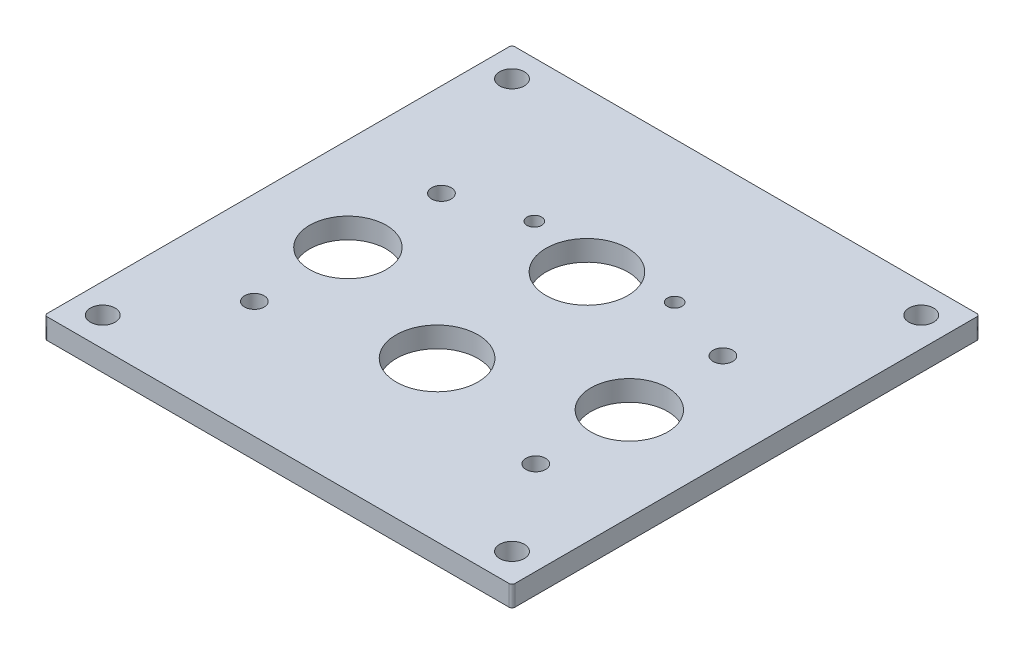
ISO-10303-21;
HEADER;
FILE_DESCRIPTION(('STEP AP214'),'2;1');
FILE_NAME('part.step','',(''),(''),'','','');
FILE_SCHEMA(('AUTOMOTIVE_DESIGN { 1 0 10303 214 1 1 1 1 }'));
ENDSEC;
DATA;
#1=APPLICATION_CONTEXT('core data for automotive mechanical design processes');
#2=APPLICATION_PROTOCOL_DEFINITION('international standard','automotive_design',2000,#1);
#3=PRODUCT_CONTEXT('',#1,'mechanical');
#4=PRODUCT('Part','Part','',(#3));
#5=PRODUCT_RELATED_PRODUCT_CATEGORY('part','',(#4));
#6=PRODUCT_DEFINITION_FORMATION('','',#4);
#7=PRODUCT_DEFINITION_CONTEXT('part definition',#1,'design');
#8=PRODUCT_DEFINITION('design','',#6,#7);
#9=PRODUCT_DEFINITION_SHAPE('','',#8);
#10=(LENGTH_UNIT() NAMED_UNIT(*) SI_UNIT(.MILLI.,.METRE.));
#11=(NAMED_UNIT(*) PLANE_ANGLE_UNIT() SI_UNIT($,.RADIAN.));
#12=(NAMED_UNIT(*) SI_UNIT($,.STERADIAN.) SOLID_ANGLE_UNIT());
#13=UNCERTAINTY_MEASURE_WITH_UNIT(LENGTH_MEASURE(1.E-05),#10,'distance_accuracy_value','');
#14=(GEOMETRIC_REPRESENTATION_CONTEXT(3) GLOBAL_UNCERTAINTY_ASSIGNED_CONTEXT((#13)) GLOBAL_UNIT_ASSIGNED_CONTEXT((#10,
#11,#12)) REPRESENTATION_CONTEXT('',''));
#15=CARTESIAN_POINT('',(0.,0.,0.));
#16=DIRECTION('',(0.,0.,1.));
#17=DIRECTION('',(1.,0.,0.));
#18=AXIS2_PLACEMENT_3D('',#15,#16,#17);
#19=CARTESIAN_POINT('',(76.3793482367759,0.,47.8960232997481));
#20=DIRECTION('',(0.,-1.,0.));
#21=DIRECTION('',(0.,0.,-1.));
#22=AXIS2_PLACEMENT_3D('',#19,#20,#21);
#23=CYLINDRICAL_SURFACE('',#22,0.793749999999989);
#24=CARTESIAN_POINT('',(76.3793482367759,0.,47.8960232997481));
#25=DIRECTION('',(0.,-1.,0.));
#26=DIRECTION('',(0.,0.,-1.));
#27=AXIS2_PLACEMENT_3D('',#24,#25,#26);
#28=CIRCLE('',#27,0.793749999999989);
#29=CARTESIAN_POINT('',(77.1730982367758,0.,47.8960232997481));
#30=VERTEX_POINT('',#29);
#31=CARTESIAN_POINT('',(76.3793482367759,0.,48.6897732997481));
#32=VERTEX_POINT('',#31);
#33=EDGE_CURVE('E92',#30,#32,#28,.T.);
#34=ORIENTED_EDGE('',*,*,#33,.T.);
#35=DIRECTION('',(0.,1.,0.));
#36=VECTOR('',#35,1.);
#37=CARTESIAN_POINT('',(76.3793482367759,0.,48.6897732997481));
#38=LINE('',#37,#36);
#39=CARTESIAN_POINT('',(76.3793482367759,-5.588,48.6897732997481));
#40=VERTEX_POINT('',#39);
#41=EDGE_CURVE('E127',#40,#32,#38,.T.);
#42=ORIENTED_EDGE('',*,*,#41,.F.);
#43=CARTESIAN_POINT('',(76.3793482367759,-5.588,47.8960232997481));
#44=DIRECTION('',(0.,-1.,0.));
#45=DIRECTION('',(0.,0.,-1.));
#46=AXIS2_PLACEMENT_3D('',#43,#44,#45);
#47=CIRCLE('',#46,0.793749999999989);
#48=CARTESIAN_POINT('',(77.1730982367758,-5.588,47.8960232997481));
#49=VERTEX_POINT('',#48);
#50=EDGE_CURVE('E27',#40,#49,#47,.F.);
#51=ORIENTED_EDGE('',*,*,#50,.T.);
#52=DIRECTION('',(0.,1.,0.));
#53=VECTOR('',#52,1.);
#54=CARTESIAN_POINT('',(77.1730982367758,0.,47.8960232997481));
#55=LINE('',#54,#53);
#56=EDGE_CURVE('E113',#30,#49,#55,.F.);
#57=ORIENTED_EDGE('',*,*,#56,.F.);
#58=EDGE_LOOP('',(#34,#42,#51,#57));
#59=FACE_BOUND('',#58,.T.);
#60=ADVANCED_FACE('F24',(#59),#23,.T.);
#61=CARTESIAN_POINT('',(-49.0331517632242,0.,47.8960232997481));
#62=DIRECTION('',(0.,-1.,0.));
#63=DIRECTION('',(0.,0.,-1.));
#64=AXIS2_PLACEMENT_3D('',#61,#62,#63);
#65=CYLINDRICAL_SURFACE('',#64,0.79375000000001);
#66=CARTESIAN_POINT('',(-49.0331517632242,0.,47.8960232997481));
#67=DIRECTION('',(0.,-1.,0.));
#68=DIRECTION('',(0.,0.,-1.));
#69=AXIS2_PLACEMENT_3D('',#66,#67,#68);
#70=CIRCLE('',#69,0.79375000000001);
#71=CARTESIAN_POINT('',(-49.0331517632242,0.,48.6897732997481));
#72=VERTEX_POINT('',#71);
#73=CARTESIAN_POINT('',(-49.8269017632242,0.,47.8960232997481));
#74=VERTEX_POINT('',#73);
#75=EDGE_CURVE('E221',#72,#74,#70,.T.);
#76=ORIENTED_EDGE('',*,*,#75,.T.);
#77=DIRECTION('',(0.,1.,0.));
#78=VECTOR('',#77,1.);
#79=CARTESIAN_POINT('',(-49.8269017632242,0.,47.8960232997481));
#80=LINE('',#79,#78);
#81=CARTESIAN_POINT('',(-49.8269017632242,-5.588,47.8960232997481));
#82=VERTEX_POINT('',#81);
#83=EDGE_CURVE('E135',#82,#74,#80,.T.);
#84=ORIENTED_EDGE('',*,*,#83,.F.);
#85=CARTESIAN_POINT('',(-49.0331517632242,-5.588,47.8960232997481));
#86=DIRECTION('',(0.,-1.,0.));
#87=DIRECTION('',(0.,0.,-1.));
#88=AXIS2_PLACEMENT_3D('',#85,#86,#87);
#89=CIRCLE('',#88,0.79375000000001);
#90=CARTESIAN_POINT('',(-49.0331517632242,-5.588,48.6897732997481));
#91=VERTEX_POINT('',#90);
#92=EDGE_CURVE('E224',#82,#91,#89,.F.);
#93=ORIENTED_EDGE('',*,*,#92,.T.);
#94=DIRECTION('',(0.,1.,0.));
#95=VECTOR('',#94,1.);
#96=CARTESIAN_POINT('',(-49.0331517632242,0.,48.6897732997481));
#97=LINE('',#96,#95);
#98=EDGE_CURVE('E124',#72,#91,#97,.F.);
#99=ORIENTED_EDGE('',*,*,#98,.F.);
#100=EDGE_LOOP('',(#76,#84,#93,#99));
#101=FACE_BOUND('',#100,.T.);
#102=ADVANCED_FACE('F229',(#101),#65,.T.);
#103=CARTESIAN_POINT('',(-49.0331517632242,0.,-77.5164767002519));
#104=DIRECTION('',(0.,-1.,0.));
#105=DIRECTION('',(0.,0.,-1.));
#106=AXIS2_PLACEMENT_3D('',#103,#104,#105);
#107=CYLINDRICAL_SURFACE('',#106,0.793749999999996);
#108=CARTESIAN_POINT('',(-49.0331517632242,0.,-77.5164767002519));
#109=DIRECTION('',(0.,-1.,0.));
#110=DIRECTION('',(0.,0.,-1.));
#111=AXIS2_PLACEMENT_3D('',#108,#109,#110);
#112=CIRCLE('',#111,0.793749999999996);
#113=CARTESIAN_POINT('',(-49.8269017632242,0.,-77.5164767002519));
#114=VERTEX_POINT('',#113);
#115=CARTESIAN_POINT('',(-49.0331517632242,0.,-78.3102267002519));
#116=VERTEX_POINT('',#115);
#117=EDGE_CURVE('E219',#114,#116,#112,.T.);
#118=ORIENTED_EDGE('',*,*,#117,.T.);
#119=DIRECTION('',(0.,1.,0.));
#120=VECTOR('',#119,1.);
#121=CARTESIAN_POINT('',(-49.0331517632242,0.,-78.3102267002519));
#122=LINE('',#121,#120);
#123=CARTESIAN_POINT('',(-49.0331517632242,-5.588,-78.3102267002519));
#124=VERTEX_POINT('',#123);
#125=EDGE_CURVE('E130',#124,#116,#122,.T.);
#126=ORIENTED_EDGE('',*,*,#125,.F.);
#127=CARTESIAN_POINT('',(-49.0331517632242,-5.588,-77.5164767002519));
#128=DIRECTION('',(0.,-1.,0.));
#129=DIRECTION('',(0.,0.,-1.));
#130=AXIS2_PLACEMENT_3D('',#127,#128,#129);
#131=CIRCLE('',#130,0.793749999999996);
#132=CARTESIAN_POINT('',(-49.8269017632242,-5.588,-77.5164767002519));
#133=VERTEX_POINT('',#132);
#134=EDGE_CURVE('E41',#124,#133,#131,.F.);
#135=ORIENTED_EDGE('',*,*,#134,.T.);
#136=DIRECTION('',(0.,1.,0.));
#137=VECTOR('',#136,1.);
#138=CARTESIAN_POINT('',(-49.8269017632242,0.,-77.5164767002519));
#139=LINE('',#138,#137);
#140=EDGE_CURVE('E134',#114,#133,#139,.F.);
#141=ORIENTED_EDGE('',*,*,#140,.F.);
#142=EDGE_LOOP('',(#118,#126,#135,#141));
#143=FACE_BOUND('',#142,.T.);
#144=ADVANCED_FACE('F253',(#143),#107,.T.);
#145=CARTESIAN_POINT('',(76.3793482367759,0.,-77.5164767002519));
#146=DIRECTION('',(0.,-1.,0.));
#147=DIRECTION('',(0.,0.,-1.));
#148=AXIS2_PLACEMENT_3D('',#145,#146,#147);
#149=PLANE('',#148);
#150=DIRECTION('',(-1.,0.,0.));
#151=VECTOR('',#150,1.);
#152=CARTESIAN_POINT('',(-49.0331517632242,0.,-78.3102267002519));
#153=LINE('',#152,#151);
#154=CARTESIAN_POINT('',(76.3793482367759,0.,-78.3102267002519));
#155=VERTEX_POINT('',#154);
#156=EDGE_CURVE('E128',#116,#155,#153,.F.);
#157=ORIENTED_EDGE('',*,*,#156,.F.);
#158=ORIENTED_EDGE('',*,*,#117,.F.);
#159=DIRECTION('',(0.,0.,1.));
#160=VECTOR('',#159,1.);
#161=CARTESIAN_POINT('',(-49.8269017632242,0.,47.8960232997481));
#162=LINE('',#161,#160);
#163=EDGE_CURVE('E131',#74,#114,#162,.F.);
#164=ORIENTED_EDGE('',*,*,#163,.F.);
#165=ORIENTED_EDGE('',*,*,#75,.F.);
#166=DIRECTION('',(1.,0.,0.));
#167=VECTOR('',#166,1.);
#168=CARTESIAN_POINT('',(76.3793482367759,0.,48.6897732997481));
#169=LINE('',#168,#167);
#170=EDGE_CURVE('E136',#32,#72,#169,.F.);
#171=ORIENTED_EDGE('',*,*,#170,.F.);
#172=ORIENTED_EDGE('',*,*,#33,.F.);
#173=DIRECTION('',(0.,0.,-1.));
#174=VECTOR('',#173,1.);
#175=CARTESIAN_POINT('',(77.1730982367758,0.,-77.5164767002519));
#176=LINE('',#175,#174);
#177=CARTESIAN_POINT('',(77.1730982367758,0.,-77.5164767002519));
#178=VERTEX_POINT('',#177);
#179=EDGE_CURVE('E109',#178,#30,#176,.F.);
#180=ORIENTED_EDGE('',*,*,#179,.F.);
#181=CARTESIAN_POINT('',(76.3793482367759,0.,-77.5164767002519));
#182=DIRECTION('',(0.,-1.,0.));
#183=DIRECTION('',(0.,0.,-1.));
#184=AXIS2_PLACEMENT_3D('',#181,#182,#183);
#185=CIRCLE('',#184,0.793749999999996);
#186=EDGE_CURVE('E97',#155,#178,#185,.T.);
#187=ORIENTED_EDGE('',*,*,#186,.F.);
#188=EDGE_LOOP('',(#157,#158,#164,#165,#171,#172,#180,#187));
#189=FACE_BOUND('',#188,.T.);
#190=CARTESIAN_POINT('',(-5.37690176322416,0.,-39.9181267002519));
#191=DIRECTION('',(0.,-1.,0.));
#192=DIRECTION('',(0.,0.,-1.));
#193=AXIS2_PLACEMENT_3D('',#190,#191,#192);
#194=CIRCLE('',#193,1.98374);
#195=CARTESIAN_POINT('',(-5.37690176322416,0.,-41.9018667002519));
#196=VERTEX_POINT('',#195);
#197=EDGE_CURVE('E117',#196,#196,#194,.T.);
#198=ORIENTED_EDGE('',*,*,#197,.T.);
#199=EDGE_LOOP('',(#198));
#200=FACE_BOUND('',#199,.T.);
#201=CARTESIAN_POINT('',(32.7230982367758,0.,-39.9181267002519));
#202=DIRECTION('',(0.,-1.,0.));
#203=DIRECTION('',(0.,0.,-1.));
#204=AXIS2_PLACEMENT_3D('',#201,#202,#203);
#205=CIRCLE('',#204,1.98374);
#206=CARTESIAN_POINT('',(32.7230982367758,0.,-41.9018667002519));
#207=VERTEX_POINT('',#206);
#208=EDGE_CURVE('E120',#207,#207,#205,.T.);
#209=ORIENTED_EDGE('',*,*,#208,.T.);
#210=EDGE_LOOP('',(#209));
#211=FACE_BOUND('',#210,.T.);
#212=CARTESIAN_POINT('',(51.8813432040601,0.,-33.8602267002519));
#213=DIRECTION('',(0.,-1.,0.));
#214=DIRECTION('',(0.,0.,-1.));
#215=AXIS2_PLACEMENT_3D('',#212,#213,#214);
#216=CIRCLE('',#215,2.667);
#217=CARTESIAN_POINT('',(51.8813432040601,0.,-36.5272267002519));
#218=VERTEX_POINT('',#217);
#219=EDGE_CURVE('E183',#218,#218,#216,.T.);
#220=ORIENTED_EDGE('',*,*,#219,.T.);
#221=EDGE_LOOP('',(#220));
#222=FACE_BOUND('',#221,.T.);
#223=CARTESIAN_POINT('',(-41.8894017632242,0.,40.7522732997481));
#224=DIRECTION('',(0.,-1.,0.));
#225=DIRECTION('',(0.,0.,-1.));
#226=AXIS2_PLACEMENT_3D('',#223,#224,#225);
#227=CIRCLE('',#226,3.3528);
#228=CARTESIAN_POINT('',(-41.8894017632242,0.,37.3994732997481));
#229=VERTEX_POINT('',#228);
#230=EDGE_CURVE('E186',#229,#229,#227,.T.);
#231=ORIENTED_EDGE('',*,*,#230,.T.);
#232=EDGE_LOOP('',(#231));
#233=FACE_BOUND('',#232,.T.);
#234=CARTESIAN_POINT('',(13.6730982367758,0.,5.53517329974811));
#235=DIRECTION('',(0.,-1.,0.));
#236=DIRECTION('',(0.,0.,-1.));
#237=AXIS2_PLACEMENT_3D('',#234,#235,#236);
#238=CIRCLE('',#237,11.1125);
#239=CARTESIAN_POINT('',(13.6730982367758,0.,-5.57732670025189));
#240=VERTEX_POINT('',#239);
#241=EDGE_CURVE('E189',#240,#240,#238,.T.);
#242=ORIENTED_EDGE('',*,*,#241,.T.);
#243=EDGE_LOOP('',(#242));
#244=FACE_BOUND('',#243,.T.);
#245=CARTESIAN_POINT('',(69.2355982367759,0.,-70.3727267002519));
#246=DIRECTION('',(0.,-1.,0.));
#247=DIRECTION('',(0.,0.,-1.));
#248=AXIS2_PLACEMENT_3D('',#245,#246,#247);
#249=CIRCLE('',#248,3.3528);
#250=CARTESIAN_POINT('',(69.2355982367759,0.,-73.7255267002519));
#251=VERTEX_POINT('',#250);
#252=EDGE_CURVE('E192',#251,#251,#249,.T.);
#253=ORIENTED_EDGE('',*,*,#252,.T.);
#254=EDGE_LOOP('',(#253));
#255=FACE_BOUND('',#254,.T.);
#256=CARTESIAN_POINT('',(69.2355982367758,0.,40.7522732997481));
#257=DIRECTION('',(0.,-1.,0.));
#258=DIRECTION('',(0.,0.,-1.));
#259=AXIS2_PLACEMENT_3D('',#256,#257,#258);
#260=CIRCLE('',#259,3.3528);
#261=CARTESIAN_POINT('',(69.2355982367758,0.,37.3994732997481));
#262=VERTEX_POINT('',#261);
#263=EDGE_CURVE('E195',#262,#262,#260,.T.);
#264=ORIENTED_EDGE('',*,*,#263,.T.);
#265=EDGE_LOOP('',(#264));
#266=FACE_BOUND('',#265,.T.);
#267=CARTESIAN_POINT('',(-41.8894017632242,0.,-70.3727267002519));
#268=DIRECTION('',(0.,-1.,0.));
#269=DIRECTION('',(0.,0.,-1.));
#270=AXIS2_PLACEMENT_3D('',#267,#268,#269);
#271=CIRCLE('',#270,3.3528);
#272=CARTESIAN_POINT('',(-41.8894017632242,0.,-73.7255267002519));
#273=VERTEX_POINT('',#272);
#274=EDGE_CURVE('E198',#273,#273,#271,.T.);
#275=ORIENTED_EDGE('',*,*,#274,.T.);
#276=EDGE_LOOP('',(#275));
#277=FACE_BOUND('',#276,.T.);
#278=CARTESIAN_POINT('',(13.6730982367758,0.,-35.1556267002519));
#279=DIRECTION('',(0.,-1.,0.));
#280=DIRECTION('',(0.,0.,-1.));
#281=AXIS2_PLACEMENT_3D('',#278,#279,#280);
#282=CIRCLE('',#281,11.1125);
#283=CARTESIAN_POINT('',(13.6730982367758,0.,-46.2681267002519));
#284=VERTEX_POINT('',#283);
#285=EDGE_CURVE('E201',#284,#284,#282,.T.);
#286=ORIENTED_EDGE('',*,*,#285,.T.);
#287=EDGE_LOOP('',(#286));
#288=FACE_BOUND('',#287,.T.);
#289=CARTESIAN_POINT('',(51.8813432040601,0.,16.9397732997481));
#290=DIRECTION('',(0.,-1.,0.));
#291=DIRECTION('',(0.,0.,-1.));
#292=AXIS2_PLACEMENT_3D('',#289,#290,#291);
#293=CIRCLE('',#292,2.667);
#294=CARTESIAN_POINT('',(51.8813432040601,0.,14.2727732997481));
#295=VERTEX_POINT('',#294);
#296=EDGE_CURVE('E204',#295,#295,#293,.T.);
#297=ORIENTED_EDGE('',*,*,#296,.T.);
#298=EDGE_LOOP('',(#297));
#299=FACE_BOUND('',#298,.T.);
#300=CARTESIAN_POINT('',(-24.5351467305084,0.,-8.4602267002519));
#301=DIRECTION('',(0.,-1.,0.));
#302=DIRECTION('',(0.,0.,-1.));
#303=AXIS2_PLACEMENT_3D('',#300,#301,#302);
#304=CIRCLE('',#303,10.414);
#305=CARTESIAN_POINT('',(-24.5351467305084,0.,-18.8742267002519));
#306=VERTEX_POINT('',#305);
#307=EDGE_CURVE('E207',#306,#306,#304,.T.);
#308=ORIENTED_EDGE('',*,*,#307,.T.);
#309=EDGE_LOOP('',(#308));
#310=FACE_BOUND('',#309,.T.);
#311=CARTESIAN_POINT('',(-24.5351467305084,0.,16.9397732997481));
#312=DIRECTION('',(0.,-1.,0.));
#313=DIRECTION('',(0.,0.,-1.));
#314=AXIS2_PLACEMENT_3D('',#311,#312,#313);
#315=CIRCLE('',#314,2.667);
#316=CARTESIAN_POINT('',(-24.5351467305084,0.,14.2727732997481));
#317=VERTEX_POINT('',#316);
#318=EDGE_CURVE('E210',#317,#317,#315,.T.);
#319=ORIENTED_EDGE('',*,*,#318,.T.);
#320=EDGE_LOOP('',(#319));
#321=FACE_BOUND('',#320,.T.);
#322=CARTESIAN_POINT('',(-24.5351467305084,0.,-33.8602267002519));
#323=DIRECTION('',(0.,-1.,0.));
#324=DIRECTION('',(0.,0.,-1.));
#325=AXIS2_PLACEMENT_3D('',#322,#323,#324);
#326=CIRCLE('',#325,2.667);
#327=CARTESIAN_POINT('',(-24.5351467305084,0.,-36.5272267002519));
#328=VERTEX_POINT('',#327);
#329=EDGE_CURVE('E213',#328,#328,#326,.T.);
#330=ORIENTED_EDGE('',*,*,#329,.T.);
#331=EDGE_LOOP('',(#330));
#332=FACE_BOUND('',#331,.T.);
#333=CARTESIAN_POINT('',(51.8813432040601,0.,-8.4602267002519));
#334=DIRECTION('',(0.,-1.,0.));
#335=DIRECTION('',(0.,0.,-1.));
#336=AXIS2_PLACEMENT_3D('',#333,#334,#335);
#337=CIRCLE('',#336,10.414);
#338=CARTESIAN_POINT('',(51.8813432040601,0.,-18.8742267002519));
#339=VERTEX_POINT('',#338);
#340=EDGE_CURVE('E106',#339,#339,#337,.T.);
#341=ORIENTED_EDGE('',*,*,#340,.T.);
#342=EDGE_LOOP('',(#341));
#343=FACE_BOUND('',#342,.T.);
#344=ADVANCED_FACE('F110',(#189,#200,#211,#222,#233,#244,#255,#266,#277,#288,#299,#310,#321,
#332,#343),#149,.F.);
#345=CARTESIAN_POINT('',(76.3793482367759,0.,-77.5164767002519));
#346=DIRECTION('',(0.,-1.,0.));
#347=DIRECTION('',(0.,0.,-1.));
#348=AXIS2_PLACEMENT_3D('',#345,#346,#347);
#349=CYLINDRICAL_SURFACE('',#348,0.793749999999996);
#350=ORIENTED_EDGE('',*,*,#186,.T.);
#351=DIRECTION('',(0.,1.,0.));
#352=VECTOR('',#351,1.);
#353=CARTESIAN_POINT('',(77.1730982367758,0.,-77.5164767002519));
#354=LINE('',#353,#352);
#355=CARTESIAN_POINT('',(77.1730982367758,-5.588,-77.5164767002519));
#356=VERTEX_POINT('',#355);
#357=EDGE_CURVE('E100',#356,#178,#354,.T.);
#358=ORIENTED_EDGE('',*,*,#357,.F.);
#359=CARTESIAN_POINT('',(76.3793482367759,-5.588,-77.5164767002519));
#360=DIRECTION('',(0.,-1.,0.));
#361=DIRECTION('',(0.,0.,-1.));
#362=AXIS2_PLACEMENT_3D('',#359,#360,#361);
#363=CIRCLE('',#362,0.793749999999996);
#364=CARTESIAN_POINT('',(76.3793482367759,-5.588,-78.3102267002519));
#365=VERTEX_POINT('',#364);
#366=EDGE_CURVE('E67',#356,#365,#363,.F.);
#367=ORIENTED_EDGE('',*,*,#366,.T.);
#368=DIRECTION('',(0.,1.,0.));
#369=VECTOR('',#368,1.);
#370=CARTESIAN_POINT('',(76.3793482367759,0.,-78.3102267002519));
#371=LINE('',#370,#369);
#372=EDGE_CURVE('E103',#155,#365,#371,.F.);
#373=ORIENTED_EDGE('',*,*,#372,.F.);
#374=EDGE_LOOP('',(#350,#358,#367,#373));
#375=FACE_BOUND('',#374,.T.);
#376=ADVANCED_FACE('F98',(#375),#349,.T.);
#377=CARTESIAN_POINT('',(51.8813432040601,0.,-8.4602267002519));
#378=DIRECTION('',(0.,-1.,0.));
#379=DIRECTION('',(0.,0.,-1.));
#380=AXIS2_PLACEMENT_3D('',#377,#378,#379);
#381=CYLINDRICAL_SURFACE('',#380,10.414);
#382=CARTESIAN_POINT('',(51.8813432040601,-5.588,-8.4602267002519));
#383=DIRECTION('',(0.,-1.,0.));
#384=DIRECTION('',(0.,0.,-1.));
#385=AXIS2_PLACEMENT_3D('',#382,#383,#384);
#386=CIRCLE('',#385,10.414);
#387=CARTESIAN_POINT('',(51.8813432040601,-5.588,-18.8742267002519));
#388=VERTEX_POINT('',#387);
#389=EDGE_CURVE('E178',#388,#388,#386,.F.);
#390=ORIENTED_EDGE('',*,*,#389,.F.);
#391=EDGE_LOOP('',(#390));
#392=FACE_BOUND('',#391,.T.);
#393=ORIENTED_EDGE('',*,*,#340,.F.);
#394=EDGE_LOOP('',(#393));
#395=FACE_BOUND('',#394,.T.);
#396=ADVANCED_FACE('F322',(#392,#395),#381,.F.);
#397=CARTESIAN_POINT('',(-24.5351467305084,0.,-33.8602267002519));
#398=DIRECTION('',(0.,-1.,0.));
#399=DIRECTION('',(0.,0.,-1.));
#400=AXIS2_PLACEMENT_3D('',#397,#398,#399);
#401=CYLINDRICAL_SURFACE('',#400,2.667);
#402=CARTESIAN_POINT('',(-24.5351467305084,-5.588,-33.8602267002519));
#403=DIRECTION('',(0.,-1.,0.));
#404=DIRECTION('',(0.,0.,-1.));
#405=AXIS2_PLACEMENT_3D('',#402,#403,#404);
#406=CIRCLE('',#405,2.667);
#407=CARTESIAN_POINT('',(-24.5351467305084,-5.588,-36.5272267002519));
#408=VERTEX_POINT('',#407);
#409=EDGE_CURVE('E175',#408,#408,#406,.F.);
#410=ORIENTED_EDGE('',*,*,#409,.F.);
#411=EDGE_LOOP('',(#410));
#412=FACE_BOUND('',#411,.T.);
#413=ORIENTED_EDGE('',*,*,#329,.F.);
#414=EDGE_LOOP('',(#413));
#415=FACE_BOUND('',#414,.T.);
#416=ADVANCED_FACE('F318',(#412,#415),#401,.F.);
#417=CARTESIAN_POINT('',(-24.5351467305084,0.,16.9397732997481));
#418=DIRECTION('',(0.,-1.,0.));
#419=DIRECTION('',(0.,0.,-1.));
#420=AXIS2_PLACEMENT_3D('',#417,#418,#419);
#421=CYLINDRICAL_SURFACE('',#420,2.667);
#422=CARTESIAN_POINT('',(-24.5351467305084,-5.588,16.9397732997481));
#423=DIRECTION('',(0.,-1.,0.));
#424=DIRECTION('',(0.,0.,-1.));
#425=AXIS2_PLACEMENT_3D('',#422,#423,#424);
#426=CIRCLE('',#425,2.667);
#427=CARTESIAN_POINT('',(-24.5351467305084,-5.588,14.2727732997481));
#428=VERTEX_POINT('',#427);
#429=EDGE_CURVE('E172',#428,#428,#426,.F.);
#430=ORIENTED_EDGE('',*,*,#429,.F.);
#431=EDGE_LOOP('',(#430));
#432=FACE_BOUND('',#431,.T.);
#433=ORIENTED_EDGE('',*,*,#318,.F.);
#434=EDGE_LOOP('',(#433));
#435=FACE_BOUND('',#434,.T.);
#436=ADVANCED_FACE('F314',(#432,#435),#421,.F.);
#437=CARTESIAN_POINT('',(-24.5351467305084,0.,-8.4602267002519));
#438=DIRECTION('',(0.,-1.,0.));
#439=DIRECTION('',(0.,0.,-1.));
#440=AXIS2_PLACEMENT_3D('',#437,#438,#439);
#441=CYLINDRICAL_SURFACE('',#440,10.414);
#442=CARTESIAN_POINT('',(-24.5351467305084,-5.588,-8.4602267002519));
#443=DIRECTION('',(0.,-1.,0.));
#444=DIRECTION('',(0.,0.,-1.));
#445=AXIS2_PLACEMENT_3D('',#442,#443,#444);
#446=CIRCLE('',#445,10.414);
#447=CARTESIAN_POINT('',(-24.5351467305084,-5.588,-18.8742267002519));
#448=VERTEX_POINT('',#447);
#449=EDGE_CURVE('E169',#448,#448,#446,.F.);
#450=ORIENTED_EDGE('',*,*,#449,.F.);
#451=EDGE_LOOP('',(#450));
#452=FACE_BOUND('',#451,.T.);
#453=ORIENTED_EDGE('',*,*,#307,.F.);
#454=EDGE_LOOP('',(#453));
#455=FACE_BOUND('',#454,.T.);
#456=ADVANCED_FACE('F310',(#452,#455),#441,.F.);
#457=CARTESIAN_POINT('',(51.8813432040601,0.,16.9397732997481));
#458=DIRECTION('',(0.,-1.,0.));
#459=DIRECTION('',(0.,0.,-1.));
#460=AXIS2_PLACEMENT_3D('',#457,#458,#459);
#461=CYLINDRICAL_SURFACE('',#460,2.667);
#462=CARTESIAN_POINT('',(51.8813432040601,-5.588,16.9397732997481));
#463=DIRECTION('',(0.,-1.,0.));
#464=DIRECTION('',(0.,0.,-1.));
#465=AXIS2_PLACEMENT_3D('',#462,#463,#464);
#466=CIRCLE('',#465,2.667);
#467=CARTESIAN_POINT('',(51.8813432040601,-5.588,14.2727732997481));
#468=VERTEX_POINT('',#467);
#469=EDGE_CURVE('E166',#468,#468,#466,.F.);
#470=ORIENTED_EDGE('',*,*,#469,.F.);
#471=EDGE_LOOP('',(#470));
#472=FACE_BOUND('',#471,.T.);
#473=ORIENTED_EDGE('',*,*,#296,.F.);
#474=EDGE_LOOP('',(#473));
#475=FACE_BOUND('',#474,.T.);
#476=ADVANCED_FACE('F306',(#472,#475),#461,.F.);
#477=CARTESIAN_POINT('',(13.6730982367758,0.,-35.1556267002519));
#478=DIRECTION('',(0.,-1.,0.));
#479=DIRECTION('',(0.,0.,-1.));
#480=AXIS2_PLACEMENT_3D('',#477,#478,#479);
#481=CYLINDRICAL_SURFACE('',#480,11.1125);
#482=CARTESIAN_POINT('',(13.6730982367758,-5.588,-35.1556267002519));
#483=DIRECTION('',(0.,-1.,0.));
#484=DIRECTION('',(0.,0.,-1.));
#485=AXIS2_PLACEMENT_3D('',#482,#483,#484);
#486=CIRCLE('',#485,11.1125);
#487=CARTESIAN_POINT('',(13.6730982367758,-5.588,-46.2681267002519));
#488=VERTEX_POINT('',#487);
#489=EDGE_CURVE('E163',#488,#488,#486,.F.);
#490=ORIENTED_EDGE('',*,*,#489,.F.);
#491=EDGE_LOOP('',(#490));
#492=FACE_BOUND('',#491,.T.);
#493=ORIENTED_EDGE('',*,*,#285,.F.);
#494=EDGE_LOOP('',(#493));
#495=FACE_BOUND('',#494,.T.);
#496=ADVANCED_FACE('F302',(#492,#495),#481,.F.);
#497=CARTESIAN_POINT('',(-41.8894017632242,0.,-70.3727267002519));
#498=DIRECTION('',(0.,-1.,0.));
#499=DIRECTION('',(0.,0.,-1.));
#500=AXIS2_PLACEMENT_3D('',#497,#498,#499);
#501=CYLINDRICAL_SURFACE('',#500,3.3528);
#502=CARTESIAN_POINT('',(-41.8894017632242,-5.588,-70.3727267002519));
#503=DIRECTION('',(0.,-1.,0.));
#504=DIRECTION('',(0.,0.,-1.));
#505=AXIS2_PLACEMENT_3D('',#502,#503,#504);
#506=CIRCLE('',#505,3.3528);
#507=CARTESIAN_POINT('',(-41.8894017632242,-5.588,-73.7255267002519));
#508=VERTEX_POINT('',#507);
#509=EDGE_CURVE('E160',#508,#508,#506,.F.);
#510=ORIENTED_EDGE('',*,*,#509,.F.);
#511=EDGE_LOOP('',(#510));
#512=FACE_BOUND('',#511,.T.);
#513=ORIENTED_EDGE('',*,*,#274,.F.);
#514=EDGE_LOOP('',(#513));
#515=FACE_BOUND('',#514,.T.);
#516=ADVANCED_FACE('F298',(#512,#515),#501,.F.);
#517=CARTESIAN_POINT('',(69.2355982367758,0.,40.7522732997481));
#518=DIRECTION('',(0.,-1.,0.));
#519=DIRECTION('',(0.,0.,-1.));
#520=AXIS2_PLACEMENT_3D('',#517,#518,#519);
#521=CYLINDRICAL_SURFACE('',#520,3.3528);
#522=CARTESIAN_POINT('',(69.2355982367758,-5.588,40.7522732997481));
#523=DIRECTION('',(0.,-1.,0.));
#524=DIRECTION('',(0.,0.,-1.));
#525=AXIS2_PLACEMENT_3D('',#522,#523,#524);
#526=CIRCLE('',#525,3.3528);
#527=CARTESIAN_POINT('',(69.2355982367758,-5.588,37.3994732997481));
#528=VERTEX_POINT('',#527);
#529=EDGE_CURVE('E157',#528,#528,#526,.F.);
#530=ORIENTED_EDGE('',*,*,#529,.F.);
#531=EDGE_LOOP('',(#530));
#532=FACE_BOUND('',#531,.T.);
#533=ORIENTED_EDGE('',*,*,#263,.F.);
#534=EDGE_LOOP('',(#533));
#535=FACE_BOUND('',#534,.T.);
#536=ADVANCED_FACE('F294',(#532,#535),#521,.F.);
#537=CARTESIAN_POINT('',(69.2355982367759,0.,-70.3727267002519));
#538=DIRECTION('',(0.,-1.,0.));
#539=DIRECTION('',(0.,0.,-1.));
#540=AXIS2_PLACEMENT_3D('',#537,#538,#539);
#541=CYLINDRICAL_SURFACE('',#540,3.3528);
#542=CARTESIAN_POINT('',(69.2355982367759,-5.588,-70.3727267002519));
#543=DIRECTION('',(0.,-1.,0.));
#544=DIRECTION('',(0.,0.,-1.));
#545=AXIS2_PLACEMENT_3D('',#542,#543,#544);
#546=CIRCLE('',#545,3.3528);
#547=CARTESIAN_POINT('',(69.2355982367759,-5.588,-73.7255267002519));
#548=VERTEX_POINT('',#547);
#549=EDGE_CURVE('E154',#548,#548,#546,.F.);
#550=ORIENTED_EDGE('',*,*,#549,.F.);
#551=EDGE_LOOP('',(#550));
#552=FACE_BOUND('',#551,.T.);
#553=ORIENTED_EDGE('',*,*,#252,.F.);
#554=EDGE_LOOP('',(#553));
#555=FACE_BOUND('',#554,.T.);
#556=ADVANCED_FACE('F290',(#552,#555),#541,.F.);
#557=CARTESIAN_POINT('',(13.6730982367758,0.,5.53517329974811));
#558=DIRECTION('',(0.,-1.,0.));
#559=DIRECTION('',(0.,0.,-1.));
#560=AXIS2_PLACEMENT_3D('',#557,#558,#559);
#561=CYLINDRICAL_SURFACE('',#560,11.1125);
#562=CARTESIAN_POINT('',(13.6730982367758,-5.588,5.53517329974811));
#563=DIRECTION('',(0.,-1.,0.));
#564=DIRECTION('',(0.,0.,-1.));
#565=AXIS2_PLACEMENT_3D('',#562,#563,#564);
#566=CIRCLE('',#565,11.1125);
#567=CARTESIAN_POINT('',(13.6730982367758,-5.588,-5.57732670025189));
#568=VERTEX_POINT('',#567);
#569=EDGE_CURVE('E151',#568,#568,#566,.F.);
#570=ORIENTED_EDGE('',*,*,#569,.F.);
#571=EDGE_LOOP('',(#570));
#572=FACE_BOUND('',#571,.T.);
#573=ORIENTED_EDGE('',*,*,#241,.F.);
#574=EDGE_LOOP('',(#573));
#575=FACE_BOUND('',#574,.T.);
#576=ADVANCED_FACE('F286',(#572,#575),#561,.F.);
#577=CARTESIAN_POINT('',(-41.8894017632242,0.,40.7522732997481));
#578=DIRECTION('',(0.,-1.,0.));
#579=DIRECTION('',(0.,0.,-1.));
#580=AXIS2_PLACEMENT_3D('',#577,#578,#579);
#581=CYLINDRICAL_SURFACE('',#580,3.3528);
#582=CARTESIAN_POINT('',(-41.8894017632242,-5.588,40.7522732997481));
#583=DIRECTION('',(0.,-1.,0.));
#584=DIRECTION('',(0.,0.,-1.));
#585=AXIS2_PLACEMENT_3D('',#582,#583,#584);
#586=CIRCLE('',#585,3.3528);
#587=CARTESIAN_POINT('',(-41.8894017632242,-5.588,37.3994732997481));
#588=VERTEX_POINT('',#587);
#589=EDGE_CURVE('E148',#588,#588,#586,.F.);
#590=ORIENTED_EDGE('',*,*,#589,.F.);
#591=EDGE_LOOP('',(#590));
#592=FACE_BOUND('',#591,.T.);
#593=ORIENTED_EDGE('',*,*,#230,.F.);
#594=EDGE_LOOP('',(#593));
#595=FACE_BOUND('',#594,.T.);
#596=ADVANCED_FACE('F282',(#592,#595),#581,.F.);
#597=CARTESIAN_POINT('',(51.8813432040601,0.,-33.8602267002519));
#598=DIRECTION('',(0.,-1.,0.));
#599=DIRECTION('',(0.,0.,-1.));
#600=AXIS2_PLACEMENT_3D('',#597,#598,#599);
#601=CYLINDRICAL_SURFACE('',#600,2.667);
#602=CARTESIAN_POINT('',(51.8813432040601,-5.588,-33.8602267002519));
#603=DIRECTION('',(0.,-1.,0.));
#604=DIRECTION('',(0.,0.,-1.));
#605=AXIS2_PLACEMENT_3D('',#602,#603,#604);
#606=CIRCLE('',#605,2.667);
#607=CARTESIAN_POINT('',(51.8813432040601,-5.588,-36.5272267002519));
#608=VERTEX_POINT('',#607);
#609=EDGE_CURVE('E145',#608,#608,#606,.F.);
#610=ORIENTED_EDGE('',*,*,#609,.F.);
#611=EDGE_LOOP('',(#610));
#612=FACE_BOUND('',#611,.T.);
#613=ORIENTED_EDGE('',*,*,#219,.F.);
#614=EDGE_LOOP('',(#613));
#615=FACE_BOUND('',#614,.T.);
#616=ADVANCED_FACE('F278',(#612,#615),#601,.F.);
#617=CARTESIAN_POINT('',(32.7230982367758,0.,-39.9181267002519));
#618=DIRECTION('',(0.,-1.,0.));
#619=DIRECTION('',(0.,0.,-1.));
#620=AXIS2_PLACEMENT_3D('',#617,#618,#619);
#621=CYLINDRICAL_SURFACE('',#620,1.98374);
#622=CARTESIAN_POINT('',(32.7230982367758,-5.588,-39.9181267002519));
#623=DIRECTION('',(0.,-1.,0.));
#624=DIRECTION('',(0.,0.,-1.));
#625=AXIS2_PLACEMENT_3D('',#622,#623,#624);
#626=CIRCLE('',#625,1.98374);
#627=CARTESIAN_POINT('',(32.7230982367758,-5.588,-41.9018667002519));
#628=VERTEX_POINT('',#627);
#629=EDGE_CURVE('E142',#628,#628,#626,.F.);
#630=ORIENTED_EDGE('',*,*,#629,.F.);
#631=EDGE_LOOP('',(#630));
#632=FACE_BOUND('',#631,.T.);
#633=ORIENTED_EDGE('',*,*,#208,.F.);
#634=EDGE_LOOP('',(#633));
#635=FACE_BOUND('',#634,.T.);
#636=ADVANCED_FACE('F274',(#632,#635),#621,.F.);
#637=CARTESIAN_POINT('',(-5.37690176322416,0.,-39.9181267002519));
#638=DIRECTION('',(0.,-1.,0.));
#639=DIRECTION('',(0.,0.,-1.));
#640=AXIS2_PLACEMENT_3D('',#637,#638,#639);
#641=CYLINDRICAL_SURFACE('',#640,1.98374);
#642=CARTESIAN_POINT('',(-5.37690176322416,-5.588,-39.9181267002519));
#643=DIRECTION('',(0.,-1.,0.));
#644=DIRECTION('',(0.,0.,-1.));
#645=AXIS2_PLACEMENT_3D('',#642,#643,#644);
#646=CIRCLE('',#645,1.98374);
#647=CARTESIAN_POINT('',(-5.37690176322416,-5.588,-41.9018667002519));
#648=VERTEX_POINT('',#647);
#649=EDGE_CURVE('E139',#648,#648,#646,.F.);
#650=ORIENTED_EDGE('',*,*,#649,.F.);
#651=EDGE_LOOP('',(#650));
#652=FACE_BOUND('',#651,.T.);
#653=ORIENTED_EDGE('',*,*,#197,.F.);
#654=EDGE_LOOP('',(#653));
#655=FACE_BOUND('',#654,.T.);
#656=ADVANCED_FACE('F271',(#652,#655),#641,.F.);
#657=CARTESIAN_POINT('',(77.1730982367758,0.,-77.5164767002519));
#658=DIRECTION('',(1.,0.,0.));
#659=DIRECTION('',(0.,0.,-1.));
#660=AXIS2_PLACEMENT_3D('',#657,#658,#659);
#661=PLANE('',#660);
#662=ORIENTED_EDGE('',*,*,#179,.T.);
#663=ORIENTED_EDGE('',*,*,#56,.T.);
#664=DIRECTION('',(0.,0.,-1.));
#665=VECTOR('',#664,1.);
#666=CARTESIAN_POINT('',(77.1730982367758,-5.588,-77.5164767002519));
#667=LINE('',#666,#665);
#668=EDGE_CURVE('E116',#356,#49,#667,.F.);
#669=ORIENTED_EDGE('',*,*,#668,.F.);
#670=ORIENTED_EDGE('',*,*,#357,.T.);
#671=EDGE_LOOP('',(#662,#663,#669,#670));
#672=FACE_BOUND('',#671,.T.);
#673=ADVANCED_FACE('F115',(#672),#661,.T.);
#674=CARTESIAN_POINT('',(76.3793482367759,0.,48.6897732997481));
#675=DIRECTION('',(0.,0.,1.));
#676=DIRECTION('',(1.,0.,0.));
#677=AXIS2_PLACEMENT_3D('',#674,#675,#676);
#678=PLANE('',#677);
#679=ORIENTED_EDGE('',*,*,#170,.T.);
#680=ORIENTED_EDGE('',*,*,#98,.T.);
#681=DIRECTION('',(1.,0.,0.));
#682=VECTOR('',#681,1.);
#683=CARTESIAN_POINT('',(76.3793482367759,-5.588,48.6897732997481));
#684=LINE('',#683,#682);
#685=EDGE_CURVE('E236',#40,#91,#684,.F.);
#686=ORIENTED_EDGE('',*,*,#685,.F.);
#687=ORIENTED_EDGE('',*,*,#41,.T.);
#688=EDGE_LOOP('',(#679,#680,#686,#687));
#689=FACE_BOUND('',#688,.T.);
#690=ADVANCED_FACE('F234',(#689),#678,.T.);
#691=CARTESIAN_POINT('',(-49.8269017632242,0.,47.8960232997481));
#692=DIRECTION('',(-1.,0.,0.));
#693=DIRECTION('',(0.,0.,1.));
#694=AXIS2_PLACEMENT_3D('',#691,#692,#693);
#695=PLANE('',#694);
#696=ORIENTED_EDGE('',*,*,#163,.T.);
#697=ORIENTED_EDGE('',*,*,#140,.T.);
#698=DIRECTION('',(0.,0.,-1.));
#699=VECTOR('',#698,1.);
#700=CARTESIAN_POINT('',(-49.8269017632242,-5.588,-77.5164767002519));
#701=LINE('',#700,#699);
#702=EDGE_CURVE('E33',#82,#133,#701,.T.);
#703=ORIENTED_EDGE('',*,*,#702,.F.);
#704=ORIENTED_EDGE('',*,*,#83,.T.);
#705=EDGE_LOOP('',(#696,#697,#703,#704));
#706=FACE_BOUND('',#705,.T.);
#707=ADVANCED_FACE('F251',(#706),#695,.T.);
#708=CARTESIAN_POINT('',(-49.0331517632242,0.,-78.3102267002519));
#709=DIRECTION('',(0.,0.,-1.));
#710=DIRECTION('',(-1.,0.,0.));
#711=AXIS2_PLACEMENT_3D('',#708,#709,#710);
#712=PLANE('',#711);
#713=ORIENTED_EDGE('',*,*,#156,.T.);
#714=ORIENTED_EDGE('',*,*,#372,.T.);
#715=DIRECTION('',(1.,0.,0.));
#716=VECTOR('',#715,1.);
#717=CARTESIAN_POINT('',(76.3793482367759,-5.588,-78.3102267002519));
#718=LINE('',#717,#716);
#719=EDGE_CURVE('E13',#124,#365,#718,.T.);
#720=ORIENTED_EDGE('',*,*,#719,.F.);
#721=ORIENTED_EDGE('',*,*,#125,.T.);
#722=EDGE_LOOP('',(#713,#714,#720,#721));
#723=FACE_BOUND('',#722,.T.);
#724=ADVANCED_FACE('F256',(#723),#712,.T.);
#725=CARTESIAN_POINT('',(76.3793482367759,-5.588,-77.5164767002519));
#726=DIRECTION('',(0.,-1.,0.));
#727=DIRECTION('',(0.,0.,-1.));
#728=AXIS2_PLACEMENT_3D('',#725,#726,#727);
#729=PLANE('',#728);
#730=ORIENTED_EDGE('',*,*,#134,.F.);
#731=ORIENTED_EDGE('',*,*,#719,.T.);
#732=ORIENTED_EDGE('',*,*,#366,.F.);
#733=ORIENTED_EDGE('',*,*,#668,.T.);
#734=ORIENTED_EDGE('',*,*,#50,.F.);
#735=ORIENTED_EDGE('',*,*,#685,.T.);
#736=ORIENTED_EDGE('',*,*,#92,.F.);
#737=ORIENTED_EDGE('',*,*,#702,.T.);
#738=EDGE_LOOP('',(#730,#731,#732,#733,#734,#735,#736,#737));
#739=FACE_BOUND('',#738,.T.);
#740=ORIENTED_EDGE('',*,*,#649,.T.);
#741=EDGE_LOOP('',(#740));
#742=FACE_BOUND('',#741,.T.);
#743=ORIENTED_EDGE('',*,*,#629,.T.);
#744=EDGE_LOOP('',(#743));
#745=FACE_BOUND('',#744,.T.);
#746=ORIENTED_EDGE('',*,*,#609,.T.);
#747=EDGE_LOOP('',(#746));
#748=FACE_BOUND('',#747,.T.);
#749=ORIENTED_EDGE('',*,*,#589,.T.);
#750=EDGE_LOOP('',(#749));
#751=FACE_BOUND('',#750,.T.);
#752=ORIENTED_EDGE('',*,*,#569,.T.);
#753=EDGE_LOOP('',(#752));
#754=FACE_BOUND('',#753,.T.);
#755=ORIENTED_EDGE('',*,*,#549,.T.);
#756=EDGE_LOOP('',(#755));
#757=FACE_BOUND('',#756,.T.);
#758=ORIENTED_EDGE('',*,*,#529,.T.);
#759=EDGE_LOOP('',(#758));
#760=FACE_BOUND('',#759,.T.);
#761=ORIENTED_EDGE('',*,*,#509,.T.);
#762=EDGE_LOOP('',(#761));
#763=FACE_BOUND('',#762,.T.);
#764=ORIENTED_EDGE('',*,*,#489,.T.);
#765=EDGE_LOOP('',(#764));
#766=FACE_BOUND('',#765,.T.);
#767=ORIENTED_EDGE('',*,*,#469,.T.);
#768=EDGE_LOOP('',(#767));
#769=FACE_BOUND('',#768,.T.);
#770=ORIENTED_EDGE('',*,*,#449,.T.);
#771=EDGE_LOOP('',(#770));
#772=FACE_BOUND('',#771,.T.);
#773=ORIENTED_EDGE('',*,*,#429,.T.);
#774=EDGE_LOOP('',(#773));
#775=FACE_BOUND('',#774,.T.);
#776=ORIENTED_EDGE('',*,*,#409,.T.);
#777=EDGE_LOOP('',(#776));
#778=FACE_BOUND('',#777,.T.);
#779=ORIENTED_EDGE('',*,*,#389,.T.);
#780=EDGE_LOOP('',(#779));
#781=FACE_BOUND('',#780,.T.);
#782=ADVANCED_FACE('F237',(#739,#742,#745,#748,#751,#754,#757,#760,#763,#766,#769,#772,#775,
#778,#781),#729,.T.);
#783=CLOSED_SHELL('',(#60,#102,#144,#344,#376,#396,#416,#436,#456,#476,#496,#516,#536,#556,#576,
#596,#616,#636,#656,#673,#690,#707,#724,#782));
#784=MANIFOLD_SOLID_BREP('B1',#783);
#785=ADVANCED_BREP_SHAPE_REPRESENTATION('',(#18,#784),#14);
#786=SHAPE_DEFINITION_REPRESENTATION(#9,#785);
ENDSEC;
END-ISO-10303-21;
